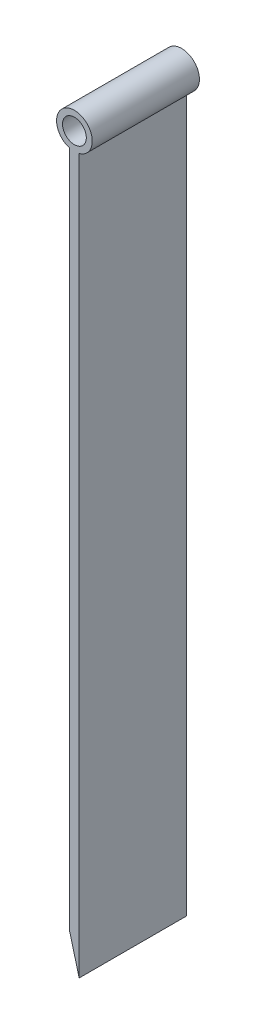
ISO-10303-21;
HEADER;
FILE_DESCRIPTION(('STEP AP214'),'2;1');
FILE_NAME('part.step','',(''),(''),'','','');
FILE_SCHEMA(('AUTOMOTIVE_DESIGN { 1 0 10303 214 1 1 1 1 }'));
ENDSEC;
DATA;
#1=APPLICATION_CONTEXT('core data for automotive mechanical design processes');
#2=APPLICATION_PROTOCOL_DEFINITION('international standard','automotive_design',2000,#1);
#3=PRODUCT_CONTEXT('',#1,'mechanical');
#4=PRODUCT('Part','Part','',(#3));
#5=PRODUCT_RELATED_PRODUCT_CATEGORY('part','',(#4));
#6=PRODUCT_DEFINITION_FORMATION('','',#4);
#7=PRODUCT_DEFINITION_CONTEXT('part definition',#1,'design');
#8=PRODUCT_DEFINITION('design','',#6,#7);
#9=PRODUCT_DEFINITION_SHAPE('','',#8);
#10=(LENGTH_UNIT() NAMED_UNIT(*) SI_UNIT(.MILLI.,.METRE.));
#11=(NAMED_UNIT(*) PLANE_ANGLE_UNIT() SI_UNIT($,.RADIAN.));
#12=(NAMED_UNIT(*) SI_UNIT($,.STERADIAN.) SOLID_ANGLE_UNIT());
#13=UNCERTAINTY_MEASURE_WITH_UNIT(LENGTH_MEASURE(1.E-05),#10,'distance_accuracy_value','');
#14=(GEOMETRIC_REPRESENTATION_CONTEXT(3) GLOBAL_UNCERTAINTY_ASSIGNED_CONTEXT((#13)) GLOBAL_UNIT_ASSIGNED_CONTEXT((#10,
#11,#12)) REPRESENTATION_CONTEXT('',''));
#15=CARTESIAN_POINT('',(0.,0.,0.));
#16=DIRECTION('',(0.,0.,1.));
#17=DIRECTION('',(1.,0.,0.));
#18=AXIS2_PLACEMENT_3D('',#15,#16,#17);
#19=CARTESIAN_POINT('',(-0.999999999999991,153.5,22.5));
#20=DIRECTION('',(0.,0.,-1.));
#21=DIRECTION('',(-1.,0.,0.));
#22=AXIS2_PLACEMENT_3D('',#19,#20,#21);
#23=CYLINDRICAL_SURFACE('',#22,3.75);
#24=CARTESIAN_POINT('',(-0.999999999999991,153.5,0.));
#25=DIRECTION('',(0.,0.,1.));
#26=DIRECTION('',(1.,0.,0.));
#27=AXIS2_PLACEMENT_3D('',#24,#25,#26);
#28=CIRCLE('',#27,3.75);
#29=CARTESIAN_POINT('',(0.,149.8857919263,0.));
#30=VERTEX_POINT('',#29);
#31=CARTESIAN_POINT('',(-1.99999999999998,149.8857919263,0.));
#32=VERTEX_POINT('',#31);
#33=EDGE_CURVE('E102',#30,#32,#28,.T.);
#34=ORIENTED_EDGE('',*,*,#33,.T.);
#35=DIRECTION('',(0.,0.,-1.));
#36=VECTOR('',#35,1.);
#37=CARTESIAN_POINT('',(-1.99999999999998,149.8857919263,22.5));
#38=LINE('',#37,#36);
#39=CARTESIAN_POINT('',(-1.99999999999998,149.8857919263,22.5));
#40=VERTEX_POINT('',#39);
#41=EDGE_CURVE('E11',#40,#32,#38,.T.);
#42=ORIENTED_EDGE('',*,*,#41,.F.);
#43=CARTESIAN_POINT('',(-0.999999999999991,153.5,22.5));
#44=DIRECTION('',(0.,0.,1.));
#45=DIRECTION('',(1.,0.,0.));
#46=AXIS2_PLACEMENT_3D('',#43,#44,#45);
#47=CIRCLE('',#46,3.75);
#48=CARTESIAN_POINT('',(0.,149.8857919263,22.5));
#49=VERTEX_POINT('',#48);
#50=EDGE_CURVE('E76',#49,#40,#47,.T.);
#51=ORIENTED_EDGE('',*,*,#50,.F.);
#52=DIRECTION('',(0.,0.,-1.));
#53=VECTOR('',#52,1.);
#54=CARTESIAN_POINT('',(0.,149.8857919263,22.5));
#55=LINE('',#54,#53);
#56=EDGE_CURVE('E52',#49,#30,#55,.T.);
#57=ORIENTED_EDGE('',*,*,#56,.T.);
#58=EDGE_LOOP('',(#34,#42,#51,#57));
#59=FACE_BOUND('',#58,.T.);
#60=ADVANCED_FACE('F35',(#59),#23,.T.);
#61=CARTESIAN_POINT('',(-1.99999999999998,0.,22.5));
#62=DIRECTION('',(-1.,0.,0.));
#63=DIRECTION('',(0.,0.,1.));
#64=AXIS2_PLACEMENT_3D('',#61,#62,#63);
#65=PLANE('',#64);
#66=DIRECTION('',(0.,1.,0.));
#67=VECTOR('',#66,1.);
#68=CARTESIAN_POINT('',(-1.99999999999998,0.,0.));
#69=LINE('',#68,#67);
#70=CARTESIAN_POINT('',(-1.99999999999998,7.50000000000001,0.));
#71=VERTEX_POINT('',#70);
#72=EDGE_CURVE('E85',#71,#32,#69,.T.);
#73=ORIENTED_EDGE('',*,*,#72,.F.);
#74=DIRECTION('',(0.,0.,-1.));
#75=VECTOR('',#74,1.);
#76=CARTESIAN_POINT('',(-1.99999999999998,7.50000000000001,22.5));
#77=LINE('',#76,#75);
#78=CARTESIAN_POINT('',(-1.99999999999998,7.50000000000001,22.5));
#79=VERTEX_POINT('',#78);
#80=EDGE_CURVE('E44',#79,#71,#77,.T.);
#81=ORIENTED_EDGE('',*,*,#80,.F.);
#82=DIRECTION('',(0.,1.,0.));
#83=VECTOR('',#82,1.);
#84=CARTESIAN_POINT('',(-1.99999999999998,0.,22.5));
#85=LINE('',#84,#83);
#86=EDGE_CURVE('E83',#79,#40,#85,.T.);
#87=ORIENTED_EDGE('',*,*,#86,.T.);
#88=ORIENTED_EDGE('',*,*,#41,.T.);
#89=EDGE_LOOP('',(#73,#81,#87,#88));
#90=FACE_BOUND('',#89,.T.);
#91=ADVANCED_FACE('F82',(#90),#65,.T.);
#92=CARTESIAN_POINT('',(0.,0.,22.5));
#93=DIRECTION('',(-0.966234939601247,-0.25766265056033,0.));
#94=DIRECTION('',(0.25766265056033,-0.966234939601247,0.));
#95=AXIS2_PLACEMENT_3D('',#92,#93,#94);
#96=PLANE('',#95);
#97=DIRECTION('',(-0.25766265056033,0.966234939601247,0.));
#98=VECTOR('',#97,1.);
#99=CARTESIAN_POINT('',(0.,0.,0.));
#100=LINE('',#99,#98);
#101=CARTESIAN_POINT('',(0.,0.,0.));
#102=VERTEX_POINT('',#101);
#103=EDGE_CURVE('E105',#102,#71,#100,.T.);
#104=ORIENTED_EDGE('',*,*,#103,.F.);
#105=DIRECTION('',(0.,0.,-1.));
#106=VECTOR('',#105,1.);
#107=CARTESIAN_POINT('',(0.,0.,22.5));
#108=LINE('',#107,#106);
#109=CARTESIAN_POINT('',(0.,0.,22.5));
#110=VERTEX_POINT('',#109);
#111=EDGE_CURVE('E65',#110,#102,#108,.T.);
#112=ORIENTED_EDGE('',*,*,#111,.F.);
#113=DIRECTION('',(-0.25766265056033,0.966234939601247,0.));
#114=VECTOR('',#113,1.);
#115=CARTESIAN_POINT('',(0.,0.,22.5));
#116=LINE('',#115,#114);
#117=EDGE_CURVE('E91',#110,#79,#116,.T.);
#118=ORIENTED_EDGE('',*,*,#117,.T.);
#119=ORIENTED_EDGE('',*,*,#80,.T.);
#120=EDGE_LOOP('',(#104,#112,#118,#119));
#121=FACE_BOUND('',#120,.T.);
#122=ADVANCED_FACE('F93',(#121),#96,.T.);
#123=CARTESIAN_POINT('',(-0.999999999999991,153.5,22.5));
#124=DIRECTION('',(0.,0.,-1.));
#125=DIRECTION('',(-1.,0.,0.));
#126=AXIS2_PLACEMENT_3D('',#123,#124,#125);
#127=CYLINDRICAL_SURFACE('',#126,2.5);
#128=CARTESIAN_POINT('',(-0.999999999999991,153.5,22.5));
#129=DIRECTION('',(0.,0.,1.));
#130=DIRECTION('',(1.,0.,0.));
#131=AXIS2_PLACEMENT_3D('',#128,#129,#130);
#132=CIRCLE('',#131,2.5);
#133=CARTESIAN_POINT('',(1.50000000000001,153.5,22.5));
#134=VERTEX_POINT('',#133);
#135=EDGE_CURVE('E110',#134,#134,#132,.T.);
#136=ORIENTED_EDGE('',*,*,#135,.T.);
#137=EDGE_LOOP('',(#136));
#138=FACE_BOUND('',#137,.T.);
#139=CARTESIAN_POINT('',(-0.999999999999991,153.5,0.));
#140=DIRECTION('',(0.,0.,1.));
#141=DIRECTION('',(1.,0.,0.));
#142=AXIS2_PLACEMENT_3D('',#139,#140,#141);
#143=CIRCLE('',#142,2.5);
#144=CARTESIAN_POINT('',(1.50000000000001,153.5,0.));
#145=VERTEX_POINT('',#144);
#146=EDGE_CURVE('E99',#145,#145,#143,.T.);
#147=ORIENTED_EDGE('',*,*,#146,.F.);
#148=EDGE_LOOP('',(#147));
#149=FACE_BOUND('',#148,.T.);
#150=ADVANCED_FACE('F37',(#138,#149),#127,.F.);
#151=CARTESIAN_POINT('',(0.,0.,22.5));
#152=DIRECTION('',(1.,0.,0.));
#153=DIRECTION('',(0.,0.,-1.));
#154=AXIS2_PLACEMENT_3D('',#151,#152,#153);
#155=PLANE('',#154);
#156=DIRECTION('',(0.,-1.,0.));
#157=VECTOR('',#156,1.);
#158=CARTESIAN_POINT('',(0.,0.,0.));
#159=LINE('',#158,#157);
#160=EDGE_CURVE('E107',#30,#102,#159,.T.);
#161=ORIENTED_EDGE('',*,*,#160,.F.);
#162=ORIENTED_EDGE('',*,*,#56,.F.);
#163=DIRECTION('',(0.,-1.,0.));
#164=VECTOR('',#163,1.);
#165=CARTESIAN_POINT('',(0.,0.,22.5));
#166=LINE('',#165,#164);
#167=EDGE_CURVE('E94',#49,#110,#166,.T.);
#168=ORIENTED_EDGE('',*,*,#167,.T.);
#169=ORIENTED_EDGE('',*,*,#111,.T.);
#170=EDGE_LOOP('',(#161,#162,#168,#169));
#171=FACE_BOUND('',#170,.T.);
#172=ADVANCED_FACE('F121',(#171),#155,.T.);
#173=CARTESIAN_POINT('',(0.,0.,22.5));
#174=DIRECTION('',(0.,0.,1.));
#175=DIRECTION('',(1.,0.,0.));
#176=AXIS2_PLACEMENT_3D('',#173,#174,#175);
#177=PLANE('',#176);
#178=ORIENTED_EDGE('',*,*,#135,.F.);
#179=EDGE_LOOP('',(#178));
#180=FACE_BOUND('',#179,.T.);
#181=ORIENTED_EDGE('',*,*,#50,.T.);
#182=ORIENTED_EDGE('',*,*,#86,.F.);
#183=ORIENTED_EDGE('',*,*,#117,.F.);
#184=ORIENTED_EDGE('',*,*,#167,.F.);
#185=EDGE_LOOP('',(#181,#182,#183,#184));
#186=FACE_BOUND('',#185,.T.);
#187=ADVANCED_FACE('F90',(#180,#186),#177,.T.);
#188=CARTESIAN_POINT('',(0.,0.,0.));
#189=DIRECTION('',(0.,0.,1.));
#190=DIRECTION('',(1.,0.,0.));
#191=AXIS2_PLACEMENT_3D('',#188,#189,#190);
#192=PLANE('',#191);
#193=ORIENTED_EDGE('',*,*,#146,.T.);
#194=EDGE_LOOP('',(#193));
#195=FACE_BOUND('',#194,.T.);
#196=ORIENTED_EDGE('',*,*,#33,.F.);
#197=ORIENTED_EDGE('',*,*,#160,.T.);
#198=ORIENTED_EDGE('',*,*,#103,.T.);
#199=ORIENTED_EDGE('',*,*,#72,.T.);
#200=EDGE_LOOP('',(#196,#197,#198,#199));
#201=FACE_BOUND('',#200,.T.);
#202=ADVANCED_FACE('F120',(#195,#201),#192,.F.);
#203=CLOSED_SHELL('',(#60,#91,#122,#150,#172,#187,#202));
#204=MANIFOLD_SOLID_BREP('B2',#203);
#205=ADVANCED_BREP_SHAPE_REPRESENTATION('',(#18,#204),#14);
#206=SHAPE_DEFINITION_REPRESENTATION(#9,#205);
ENDSEC;
END-ISO-10303-21;
